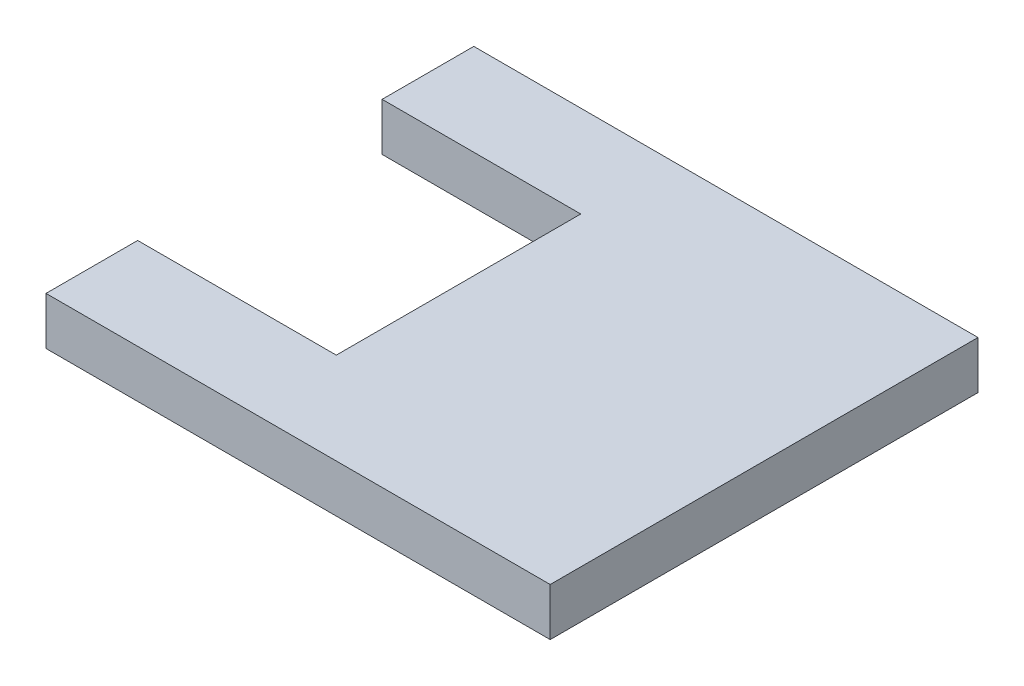
ISO-10303-21;
HEADER;
FILE_DESCRIPTION(('STEP AP214'),'2;1');
FILE_NAME('part.step','',(''),(''),'','','');
FILE_SCHEMA(('AUTOMOTIVE_DESIGN { 1 0 10303 214 1 1 1 1 }'));
ENDSEC;
DATA;
#1=APPLICATION_CONTEXT('core data for automotive mechanical design processes');
#2=APPLICATION_PROTOCOL_DEFINITION('international standard','automotive_design',2000,#1);
#3=PRODUCT_CONTEXT('',#1,'mechanical');
#4=PRODUCT('Part','Part','',(#3));
#5=PRODUCT_RELATED_PRODUCT_CATEGORY('part','',(#4));
#6=PRODUCT_DEFINITION_FORMATION('','',#4);
#7=PRODUCT_DEFINITION_CONTEXT('part definition',#1,'design');
#8=PRODUCT_DEFINITION('design','',#6,#7);
#9=PRODUCT_DEFINITION_SHAPE('','',#8);
#10=(LENGTH_UNIT() NAMED_UNIT(*) SI_UNIT(.MILLI.,.METRE.));
#11=(NAMED_UNIT(*) PLANE_ANGLE_UNIT() SI_UNIT($,.RADIAN.));
#12=(NAMED_UNIT(*) SI_UNIT($,.STERADIAN.) SOLID_ANGLE_UNIT());
#13=UNCERTAINTY_MEASURE_WITH_UNIT(LENGTH_MEASURE(1.E-05),#10,'distance_accuracy_value','');
#14=(GEOMETRIC_REPRESENTATION_CONTEXT(3) GLOBAL_UNCERTAINTY_ASSIGNED_CONTEXT((#13)) GLOBAL_UNIT_ASSIGNED_CONTEXT((#10,
#11,#12)) REPRESENTATION_CONTEXT('',''));
#15=CARTESIAN_POINT('',(0.,0.,0.));
#16=DIRECTION('',(0.,0.,1.));
#17=DIRECTION('',(1.,0.,0.));
#18=AXIS2_PLACEMENT_3D('',#15,#16,#17);
#19=CARTESIAN_POINT('',(-514.157575757575,-79.375,1511.23426840399));
#20=DIRECTION('',(-1.,0.,0.));
#21=DIRECTION('',(0.,0.,1.));
#22=AXIS2_PLACEMENT_3D('',#19,#20,#21);
#23=PLANE('',#22);
#24=DIRECTION('',(0.,0.,1.));
#25=VECTOR('',#24,1.);
#26=CARTESIAN_POINT('',(-514.157575757575,0.,1511.23426840399));
#27=LINE('',#26,#25);
#28=CARTESIAN_POINT('',(-514.157575757575,0.,1358.83426840399));
#29=VERTEX_POINT('',#28);
#30=CARTESIAN_POINT('',(-514.157575757575,0.,1511.23426840399));
#31=VERTEX_POINT('',#30);
#32=EDGE_CURVE('E159',#29,#31,#27,.T.);
#33=ORIENTED_EDGE('',*,*,#32,.F.);
#34=DIRECTION('',(0.,1.,0.));
#35=VECTOR('',#34,1.);
#36=CARTESIAN_POINT('',(-514.157575757575,-79.375,1358.83426840399));
#37=LINE('',#36,#35);
#38=CARTESIAN_POINT('',(-514.157575757575,-79.375,1358.83426840399));
#39=VERTEX_POINT('',#38);
#40=EDGE_CURVE('E11',#39,#29,#37,.T.);
#41=ORIENTED_EDGE('',*,*,#40,.F.);
#42=DIRECTION('',(0.,0.,1.));
#43=VECTOR('',#42,1.);
#44=CARTESIAN_POINT('',(-514.157575757575,-79.375,1511.23426840399));
#45=LINE('',#44,#43);
#46=CARTESIAN_POINT('',(-514.157575757575,-79.375,1511.23426840399));
#47=VERTEX_POINT('',#46);
#48=EDGE_CURVE('E185',#39,#47,#45,.T.);
#49=ORIENTED_EDGE('',*,*,#48,.T.);
#50=DIRECTION('',(0.,1.,0.));
#51=VECTOR('',#50,1.);
#52=CARTESIAN_POINT('',(-514.157575757575,-79.375,1511.23426840399));
#53=LINE('',#52,#51);
#54=EDGE_CURVE('E41',#47,#31,#53,.T.);
#55=ORIENTED_EDGE('',*,*,#54,.T.);
#56=EDGE_LOOP('',(#33,#41,#49,#55));
#57=FACE_BOUND('',#56,.T.);
#58=ADVANCED_FACE('F38',(#57),#23,.T.);
#59=CARTESIAN_POINT('',(-514.157575757575,-79.375,1358.83426840399));
#60=DIRECTION('',(0.,0.,-1.));
#61=DIRECTION('',(-1.,0.,0.));
#62=AXIS2_PLACEMENT_3D('',#59,#60,#61);
#63=PLANE('',#62);
#64=DIRECTION('',(-1.,0.,0.));
#65=VECTOR('',#64,1.);
#66=CARTESIAN_POINT('',(-514.157575757575,0.,1358.83426840399));
#67=LINE('',#66,#65);
#68=CARTESIAN_POINT('',(-183.957575757575,0.,1358.83426840399));
#69=VERTEX_POINT('',#68);
#70=EDGE_CURVE('E182',#69,#29,#67,.T.);
#71=ORIENTED_EDGE('',*,*,#70,.F.);
#72=DIRECTION('',(0.,1.,0.));
#73=VECTOR('',#72,1.);
#74=CARTESIAN_POINT('',(-183.957575757575,-79.375,1358.83426840399));
#75=LINE('',#74,#73);
#76=CARTESIAN_POINT('',(-183.957575757575,-79.375,1358.83426840399));
#77=VERTEX_POINT('',#76);
#78=EDGE_CURVE('E48',#77,#69,#75,.T.);
#79=ORIENTED_EDGE('',*,*,#78,.F.);
#80=DIRECTION('',(-1.,0.,0.));
#81=VECTOR('',#80,1.);
#82=CARTESIAN_POINT('',(-514.157575757575,-79.375,1358.83426840399));
#83=LINE('',#82,#81);
#84=EDGE_CURVE('E143',#77,#39,#83,.T.);
#85=ORIENTED_EDGE('',*,*,#84,.T.);
#86=ORIENTED_EDGE('',*,*,#40,.T.);
#87=EDGE_LOOP('',(#71,#79,#85,#86));
#88=FACE_BOUND('',#87,.T.);
#89=ADVANCED_FACE('F205',(#88),#63,.T.);
#90=CARTESIAN_POINT('',(-183.957575757575,-79.375,952.434268403986));
#91=DIRECTION('',(-1.,0.,0.));
#92=DIRECTION('',(0.,0.,1.));
#93=AXIS2_PLACEMENT_3D('',#90,#91,#92);
#94=PLANE('',#93);
#95=DIRECTION('',(0.,0.,1.));
#96=VECTOR('',#95,1.);
#97=CARTESIAN_POINT('',(-183.957575757575,0.,952.434268403986));
#98=LINE('',#97,#96);
#99=CARTESIAN_POINT('',(-183.957575757575,0.,952.434268403986));
#100=VERTEX_POINT('',#99);
#101=EDGE_CURVE('E129',#100,#69,#98,.T.);
#102=ORIENTED_EDGE('',*,*,#101,.F.);
#103=DIRECTION('',(0.,1.,0.));
#104=VECTOR('',#103,1.);
#105=CARTESIAN_POINT('',(-183.957575757575,-79.375,952.434268403986));
#106=LINE('',#105,#104);
#107=CARTESIAN_POINT('',(-183.957575757575,-79.375,952.434268403986));
#108=VERTEX_POINT('',#107);
#109=EDGE_CURVE('E124',#108,#100,#106,.T.);
#110=ORIENTED_EDGE('',*,*,#109,.F.);
#111=DIRECTION('',(0.,0.,1.));
#112=VECTOR('',#111,1.);
#113=CARTESIAN_POINT('',(-183.957575757575,-79.375,952.434268403986));
#114=LINE('',#113,#112);
#115=EDGE_CURVE('E127',#108,#77,#114,.T.);
#116=ORIENTED_EDGE('',*,*,#115,.T.);
#117=ORIENTED_EDGE('',*,*,#78,.T.);
#118=EDGE_LOOP('',(#102,#110,#116,#117));
#119=FACE_BOUND('',#118,.T.);
#120=ADVANCED_FACE('F126',(#119),#94,.T.);
#121=CARTESIAN_POINT('',(-514.157575757575,-79.375,952.434268403986));
#122=DIRECTION('',(0.,0.,1.));
#123=DIRECTION('',(1.,0.,0.));
#124=AXIS2_PLACEMENT_3D('',#121,#122,#123);
#125=PLANE('',#124);
#126=DIRECTION('',(1.,0.,0.));
#127=VECTOR('',#126,1.);
#128=CARTESIAN_POINT('',(-514.157575757575,0.,952.434268403986));
#129=LINE('',#128,#127);
#130=CARTESIAN_POINT('',(-514.157575757575,0.,952.434268403986));
#131=VERTEX_POINT('',#130);
#132=EDGE_CURVE('E178',#131,#100,#129,.T.);
#133=ORIENTED_EDGE('',*,*,#132,.F.);
#134=DIRECTION('',(0.,1.,0.));
#135=VECTOR('',#134,1.);
#136=CARTESIAN_POINT('',(-514.157575757575,-79.375,952.434268403986));
#137=LINE('',#136,#135);
#138=CARTESIAN_POINT('',(-514.157575757575,-79.375,952.434268403986));
#139=VERTEX_POINT('',#138);
#140=EDGE_CURVE('E135',#139,#131,#137,.T.);
#141=ORIENTED_EDGE('',*,*,#140,.F.);
#142=DIRECTION('',(1.,0.,0.));
#143=VECTOR('',#142,1.);
#144=CARTESIAN_POINT('',(-514.157575757575,-79.375,952.434268403986));
#145=LINE('',#144,#143);
#146=EDGE_CURVE('E141',#139,#108,#145,.T.);
#147=ORIENTED_EDGE('',*,*,#146,.T.);
#148=ORIENTED_EDGE('',*,*,#109,.T.);
#149=EDGE_LOOP('',(#133,#141,#147,#148));
#150=FACE_BOUND('',#149,.T.);
#151=ADVANCED_FACE('F146',(#150),#125,.T.);
#152=CARTESIAN_POINT('',(-514.157575757575,-79.375,952.434268403986));
#153=DIRECTION('',(-1.,0.,0.));
#154=DIRECTION('',(0.,0.,1.));
#155=AXIS2_PLACEMENT_3D('',#152,#153,#154);
#156=PLANE('',#155);
#157=DIRECTION('',(0.,0.,1.));
#158=VECTOR('',#157,1.);
#159=CARTESIAN_POINT('',(-514.157575757575,0.,952.434268403986));
#160=LINE('',#159,#158);
#161=CARTESIAN_POINT('',(-514.157575757575,0.,800.034268403986));
#162=VERTEX_POINT('',#161);
#163=EDGE_CURVE('E174',#162,#131,#160,.T.);
#164=ORIENTED_EDGE('',*,*,#163,.F.);
#165=DIRECTION('',(0.,1.,0.));
#166=VECTOR('',#165,1.);
#167=CARTESIAN_POINT('',(-514.157575757575,-79.375,800.034268403986));
#168=LINE('',#167,#166);
#169=CARTESIAN_POINT('',(-514.157575757575,-79.375,800.034268403986));
#170=VERTEX_POINT('',#169);
#171=EDGE_CURVE('E191',#170,#162,#168,.T.);
#172=ORIENTED_EDGE('',*,*,#171,.F.);
#173=DIRECTION('',(0.,0.,1.));
#174=VECTOR('',#173,1.);
#175=CARTESIAN_POINT('',(-514.157575757575,-79.375,952.434268403986));
#176=LINE('',#175,#174);
#177=EDGE_CURVE('E148',#170,#139,#176,.T.);
#178=ORIENTED_EDGE('',*,*,#177,.T.);
#179=ORIENTED_EDGE('',*,*,#140,.T.);
#180=EDGE_LOOP('',(#164,#172,#178,#179));
#181=FACE_BOUND('',#180,.T.);
#182=ADVANCED_FACE('F218',(#181),#156,.T.);
#183=CARTESIAN_POINT('',(-514.157575757575,-79.375,800.034268403986));
#184=DIRECTION('',(0.,0.,-1.));
#185=DIRECTION('',(-1.,0.,0.));
#186=AXIS2_PLACEMENT_3D('',#183,#184,#185);
#187=PLANE('',#186);
#188=DIRECTION('',(-1.,0.,0.));
#189=VECTOR('',#188,1.);
#190=CARTESIAN_POINT('',(-514.157575757575,0.,800.034268403986));
#191=LINE('',#190,#189);
#192=CARTESIAN_POINT('',(324.042424242425,0.,800.034268403986));
#193=VERTEX_POINT('',#192);
#194=EDGE_CURVE('E171',#193,#162,#191,.T.);
#195=ORIENTED_EDGE('',*,*,#194,.F.);
#196=DIRECTION('',(0.,1.,0.));
#197=VECTOR('',#196,1.);
#198=CARTESIAN_POINT('',(324.042424242425,-79.375,800.034268403986));
#199=LINE('',#198,#197);
#200=CARTESIAN_POINT('',(324.042424242425,-79.375,800.034268403986));
#201=VERTEX_POINT('',#200);
#202=EDGE_CURVE('E194',#201,#193,#199,.T.);
#203=ORIENTED_EDGE('',*,*,#202,.F.);
#204=DIRECTION('',(-1.,0.,0.));
#205=VECTOR('',#204,1.);
#206=CARTESIAN_POINT('',(-514.157575757575,-79.375,800.034268403986));
#207=LINE('',#206,#205);
#208=EDGE_CURVE('E153',#201,#170,#207,.T.);
#209=ORIENTED_EDGE('',*,*,#208,.T.);
#210=ORIENTED_EDGE('',*,*,#171,.T.);
#211=EDGE_LOOP('',(#195,#203,#209,#210));
#212=FACE_BOUND('',#211,.T.);
#213=ADVANCED_FACE('F221',(#212),#187,.T.);
#214=CARTESIAN_POINT('',(324.042424242425,-79.375,1511.23426840399));
#215=DIRECTION('',(1.,0.,0.));
#216=DIRECTION('',(0.,0.,-1.));
#217=AXIS2_PLACEMENT_3D('',#214,#215,#216);
#218=PLANE('',#217);
#219=DIRECTION('',(0.,0.,-1.));
#220=VECTOR('',#219,1.);
#221=CARTESIAN_POINT('',(324.042424242425,0.,1511.23426840399));
#222=LINE('',#221,#220);
#223=CARTESIAN_POINT('',(324.042424242425,0.,1511.23426840399));
#224=VERTEX_POINT('',#223);
#225=EDGE_CURVE('E167',#224,#193,#222,.T.);
#226=ORIENTED_EDGE('',*,*,#225,.F.);
#227=DIRECTION('',(0.,1.,0.));
#228=VECTOR('',#227,1.);
#229=CARTESIAN_POINT('',(324.042424242425,-79.375,1511.23426840399));
#230=LINE('',#229,#228);
#231=CARTESIAN_POINT('',(324.042424242425,-79.375,1511.23426840399));
#232=VERTEX_POINT('',#231);
#233=EDGE_CURVE('E196',#232,#224,#230,.T.);
#234=ORIENTED_EDGE('',*,*,#233,.F.);
#235=DIRECTION('',(0.,0.,-1.));
#236=VECTOR('',#235,1.);
#237=CARTESIAN_POINT('',(324.042424242425,-79.375,1511.23426840399));
#238=LINE('',#237,#236);
#239=EDGE_CURVE('E304',#232,#201,#238,.T.);
#240=ORIENTED_EDGE('',*,*,#239,.T.);
#241=ORIENTED_EDGE('',*,*,#202,.T.);
#242=EDGE_LOOP('',(#226,#234,#240,#241));
#243=FACE_BOUND('',#242,.T.);
#244=ADVANCED_FACE('F225',(#243),#218,.T.);
#245=CARTESIAN_POINT('',(-514.157575757575,-79.375,1511.23426840399));
#246=DIRECTION('',(0.,0.,1.));
#247=DIRECTION('',(1.,0.,0.));
#248=AXIS2_PLACEMENT_3D('',#245,#246,#247);
#249=PLANE('',#248);
#250=DIRECTION('',(1.,0.,0.));
#251=VECTOR('',#250,1.);
#252=CARTESIAN_POINT('',(-514.157575757575,0.,1511.23426840399));
#253=LINE('',#252,#251);
#254=EDGE_CURVE('E163',#31,#224,#253,.T.);
#255=ORIENTED_EDGE('',*,*,#254,.F.);
#256=ORIENTED_EDGE('',*,*,#54,.F.);
#257=DIRECTION('',(1.,0.,0.));
#258=VECTOR('',#257,1.);
#259=CARTESIAN_POINT('',(-514.157575757575,-79.375,1511.23426840399));
#260=LINE('',#259,#258);
#261=EDGE_CURVE('E307',#47,#232,#260,.T.);
#262=ORIENTED_EDGE('',*,*,#261,.T.);
#263=ORIENTED_EDGE('',*,*,#233,.T.);
#264=EDGE_LOOP('',(#255,#256,#262,#263));
#265=FACE_BOUND('',#264,.T.);
#266=ADVANCED_FACE('F202',(#265),#249,.T.);
#267=CARTESIAN_POINT('',(0.,-79.375,0.));
#268=DIRECTION('',(0.,-1.,0.));
#269=DIRECTION('',(0.,0.,-1.));
#270=AXIS2_PLACEMENT_3D('',#267,#268,#269);
#271=PLANE('',#270);
#272=ORIENTED_EDGE('',*,*,#48,.F.);
#273=ORIENTED_EDGE('',*,*,#84,.F.);
#274=ORIENTED_EDGE('',*,*,#115,.F.);
#275=ORIENTED_EDGE('',*,*,#146,.F.);
#276=ORIENTED_EDGE('',*,*,#177,.F.);
#277=ORIENTED_EDGE('',*,*,#208,.F.);
#278=ORIENTED_EDGE('',*,*,#239,.F.);
#279=ORIENTED_EDGE('',*,*,#261,.F.);
#280=EDGE_LOOP('',(#272,#273,#274,#275,#276,#277,#278,#279));
#281=FACE_BOUND('',#280,.T.);
#282=ADVANCED_FACE('F139',(#281),#271,.T.);
#283=CARTESIAN_POINT('',(0.,0.,0.));
#284=DIRECTION('',(0.,-1.,0.));
#285=DIRECTION('',(0.,0.,-1.));
#286=AXIS2_PLACEMENT_3D('',#283,#284,#285);
#287=PLANE('',#286);
#288=ORIENTED_EDGE('',*,*,#32,.T.);
#289=ORIENTED_EDGE('',*,*,#254,.T.);
#290=ORIENTED_EDGE('',*,*,#225,.T.);
#291=ORIENTED_EDGE('',*,*,#194,.T.);
#292=ORIENTED_EDGE('',*,*,#163,.T.);
#293=ORIENTED_EDGE('',*,*,#132,.T.);
#294=ORIENTED_EDGE('',*,*,#101,.T.);
#295=ORIENTED_EDGE('',*,*,#70,.T.);
#296=EDGE_LOOP('',(#288,#289,#290,#291,#292,#293,#294,#295));
#297=FACE_BOUND('',#296,.T.);
#298=ADVANCED_FACE('F204',(#297),#287,.F.);
#299=CLOSED_SHELL('',(#58,#89,#120,#151,#182,#213,#244,#266,#282,#298));
#300=MANIFOLD_SOLID_BREP('B2',#299);
#301=ADVANCED_BREP_SHAPE_REPRESENTATION('',(#18,#300),#14);
#302=SHAPE_DEFINITION_REPRESENTATION(#9,#301);
ENDSEC;
END-ISO-10303-21;
